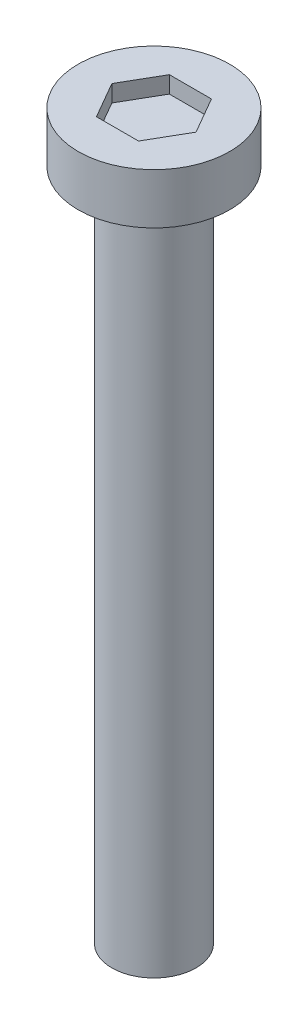
ISO-10303-21;
HEADER;
FILE_DESCRIPTION(('STEP AP214'),'2;1');
FILE_NAME('part.step','',(''),(''),'','','');
FILE_SCHEMA(('AUTOMOTIVE_DESIGN { 1 0 10303 214 1 1 1 1 }'));
ENDSEC;
DATA;
#1=APPLICATION_CONTEXT('core data for automotive mechanical design processes');
#2=APPLICATION_PROTOCOL_DEFINITION('international standard','automotive_design',2000,#1);
#3=PRODUCT_CONTEXT('',#1,'mechanical');
#4=PRODUCT('Part','Part','',(#3));
#5=PRODUCT_RELATED_PRODUCT_CATEGORY('part','',(#4));
#6=PRODUCT_DEFINITION_FORMATION('','',#4);
#7=PRODUCT_DEFINITION_CONTEXT('part definition',#1,'design');
#8=PRODUCT_DEFINITION('design','',#6,#7);
#9=PRODUCT_DEFINITION_SHAPE('','',#8);
#10=(LENGTH_UNIT() NAMED_UNIT(*) SI_UNIT(.MILLI.,.METRE.));
#11=(NAMED_UNIT(*) PLANE_ANGLE_UNIT() SI_UNIT($,.RADIAN.));
#12=(NAMED_UNIT(*) SI_UNIT($,.STERADIAN.) SOLID_ANGLE_UNIT());
#13=UNCERTAINTY_MEASURE_WITH_UNIT(LENGTH_MEASURE(1.E-05),#10,'distance_accuracy_value','');
#14=(GEOMETRIC_REPRESENTATION_CONTEXT(3) GLOBAL_UNCERTAINTY_ASSIGNED_CONTEXT((#13)) GLOBAL_UNIT_ASSIGNED_CONTEXT((#10,
#11,#12)) REPRESENTATION_CONTEXT('',''));
#15=CARTESIAN_POINT('',(0.,0.,0.));
#16=DIRECTION('',(0.,0.,1.));
#17=DIRECTION('',(1.,0.,0.));
#18=AXIS2_PLACEMENT_3D('',#15,#16,#17);
#19=CARTESIAN_POINT('',(0.,20.,0.));
#20=DIRECTION('',(0.,-1.,0.));
#21=DIRECTION('',(0.,0.,-1.));
#22=AXIS2_PLACEMENT_3D('',#19,#20,#21);
#23=CYLINDRICAL_SURFACE('',#22,1.25);
#24=CARTESIAN_POINT('',(0.,20.,0.));
#25=DIRECTION('',(0.,1.,0.));
#26=DIRECTION('',(0.,0.,1.));
#27=AXIS2_PLACEMENT_3D('',#24,#25,#26);
#28=CIRCLE('',#27,1.25);
#29=CARTESIAN_POINT('',(0.,20.,1.25));
#30=VERTEX_POINT('',#29);
#31=EDGE_CURVE('E11',#30,#30,#28,.T.);
#32=ORIENTED_EDGE('',*,*,#31,.F.);
#33=EDGE_LOOP('',(#32));
#34=FACE_BOUND('',#33,.T.);
#35=CARTESIAN_POINT('',(0.,0.,0.));
#36=DIRECTION('',(0.,1.,0.));
#37=DIRECTION('',(0.,0.,1.));
#38=AXIS2_PLACEMENT_3D('',#35,#36,#37);
#39=CIRCLE('',#38,1.25);
#40=CARTESIAN_POINT('',(0.,0.,1.25));
#41=VERTEX_POINT('',#40);
#42=EDGE_CURVE('E42',#41,#41,#39,.T.);
#43=ORIENTED_EDGE('',*,*,#42,.T.);
#44=EDGE_LOOP('',(#43));
#45=FACE_BOUND('',#44,.T.);
#46=ADVANCED_FACE('F39',(#34,#45),#23,.T.);
#47=CARTESIAN_POINT('',(0.,0.,0.));
#48=DIRECTION('',(0.,1.,0.));
#49=DIRECTION('',(0.,0.,1.));
#50=AXIS2_PLACEMENT_3D('',#47,#48,#49);
#51=PLANE('',#50);
#52=ORIENTED_EDGE('',*,*,#42,.F.);
#53=EDGE_LOOP('',(#52));
#54=FACE_BOUND('',#53,.T.);
#55=ADVANCED_FACE('F189',(#54),#51,.F.);
#56=CARTESIAN_POINT('',(0.,21.5,0.));
#57=DIRECTION('',(0.,-1.,0.));
#58=DIRECTION('',(0.,0.,-1.));
#59=AXIS2_PLACEMENT_3D('',#56,#57,#58);
#60=CYLINDRICAL_SURFACE('',#59,2.25);
#61=CARTESIAN_POINT('',(0.,21.5,0.));
#62=DIRECTION('',(0.,1.,0.));
#63=DIRECTION('',(0.,0.,1.));
#64=AXIS2_PLACEMENT_3D('',#61,#62,#63);
#65=CIRCLE('',#64,2.25);
#66=CARTESIAN_POINT('',(0.,21.5,2.25));
#67=VERTEX_POINT('',#66);
#68=EDGE_CURVE('E163',#67,#67,#65,.T.);
#69=ORIENTED_EDGE('',*,*,#68,.F.);
#70=EDGE_LOOP('',(#69));
#71=FACE_BOUND('',#70,.T.);
#72=CARTESIAN_POINT('',(0.,20.,0.));
#73=DIRECTION('',(0.,1.,0.));
#74=DIRECTION('',(0.,0.,1.));
#75=AXIS2_PLACEMENT_3D('',#72,#73,#74);
#76=CIRCLE('',#75,2.25);
#77=CARTESIAN_POINT('',(0.,20.,2.25));
#78=VERTEX_POINT('',#77);
#79=EDGE_CURVE('E153',#78,#78,#76,.T.);
#80=ORIENTED_EDGE('',*,*,#79,.T.);
#81=EDGE_LOOP('',(#80));
#82=FACE_BOUND('',#81,.T.);
#83=ADVANCED_FACE('F171',(#71,#82),#60,.T.);
#84=CARTESIAN_POINT('',(0.,21.5,0.));
#85=DIRECTION('',(0.,1.,0.));
#86=DIRECTION('',(0.,0.,1.));
#87=AXIS2_PLACEMENT_3D('',#84,#85,#86);
#88=PLANE('',#87);
#89=DIRECTION('',(0.5,0.,-0.866025403784439));
#90=VECTOR('',#89,1.);
#91=CARTESIAN_POINT('',(0.625,21.5,1.08253175473055));
#92=LINE('',#91,#90);
#93=CARTESIAN_POINT('',(0.625,21.5,1.08253175473055));
#94=VERTEX_POINT('',#93);
#95=CARTESIAN_POINT('',(1.25,21.5,0.));
#96=VERTEX_POINT('',#95);
#97=EDGE_CURVE('E54',#94,#96,#92,.T.);
#98=ORIENTED_EDGE('',*,*,#97,.F.);
#99=DIRECTION('',(1.,0.,0.));
#100=VECTOR('',#99,1.);
#101=CARTESIAN_POINT('',(-0.625,21.5,1.08253175473055));
#102=LINE('',#101,#100);
#103=CARTESIAN_POINT('',(-0.625,21.5,1.08253175473055));
#104=VERTEX_POINT('',#103);
#105=EDGE_CURVE('E147',#104,#94,#102,.T.);
#106=ORIENTED_EDGE('',*,*,#105,.F.);
#107=DIRECTION('',(0.5,0.,0.866025403784439));
#108=VECTOR('',#107,1.);
#109=CARTESIAN_POINT('',(-1.25,21.5,0.));
#110=LINE('',#109,#108);
#111=CARTESIAN_POINT('',(-1.25,21.5,0.));
#112=VERTEX_POINT('',#111);
#113=EDGE_CURVE('E144',#112,#104,#110,.T.);
#114=ORIENTED_EDGE('',*,*,#113,.F.);
#115=DIRECTION('',(-0.5,0.,0.866025403784439));
#116=VECTOR('',#115,1.);
#117=CARTESIAN_POINT('',(-0.625,21.5,-1.08253175473055));
#118=LINE('',#117,#116);
#119=CARTESIAN_POINT('',(-0.625,21.5,-1.08253175473055));
#120=VERTEX_POINT('',#119);
#121=EDGE_CURVE('E102',#120,#112,#118,.T.);
#122=ORIENTED_EDGE('',*,*,#121,.F.);
#123=DIRECTION('',(-1.,0.,0.));
#124=VECTOR('',#123,1.);
#125=CARTESIAN_POINT('',(0.625,21.5,-1.08253175473055));
#126=LINE('',#125,#124);
#127=CARTESIAN_POINT('',(0.625,21.5,-1.08253175473055));
#128=VERTEX_POINT('',#127);
#129=EDGE_CURVE('E138',#128,#120,#126,.T.);
#130=ORIENTED_EDGE('',*,*,#129,.F.);
#131=DIRECTION('',(-0.5,0.,-0.866025403784439));
#132=VECTOR('',#131,1.);
#133=CARTESIAN_POINT('',(1.25,21.5,0.));
#134=LINE('',#133,#132);
#135=EDGE_CURVE('E134',#96,#128,#134,.T.);
#136=ORIENTED_EDGE('',*,*,#135,.F.);
#137=EDGE_LOOP('',(#98,#106,#114,#122,#130,#136));
#138=FACE_BOUND('',#137,.T.);
#139=ORIENTED_EDGE('',*,*,#68,.T.);
#140=EDGE_LOOP('',(#139));
#141=FACE_BOUND('',#140,.T.);
#142=ADVANCED_FACE('F176',(#138,#141),#88,.T.);
#143=CARTESIAN_POINT('',(0.,20.,0.));
#144=DIRECTION('',(0.,1.,0.));
#145=DIRECTION('',(0.,0.,1.));
#146=AXIS2_PLACEMENT_3D('',#143,#144,#145);
#147=PLANE('',#146);
#148=ORIENTED_EDGE('',*,*,#31,.T.);
#149=EDGE_LOOP('',(#148));
#150=FACE_BOUND('',#149,.T.);
#151=ORIENTED_EDGE('',*,*,#79,.F.);
#152=EDGE_LOOP('',(#151));
#153=FACE_BOUND('',#152,.T.);
#154=ADVANCED_FACE('F173',(#150,#153),#147,.F.);
#155=CARTESIAN_POINT('',(0.625,21.,1.08253175473055));
#156=DIRECTION('',(0.866025403784439,0.,0.5));
#157=DIRECTION('',(0.5,0.,-0.866025403784439));
#158=AXIS2_PLACEMENT_3D('',#155,#156,#157);
#159=PLANE('',#158);
#160=ORIENTED_EDGE('',*,*,#97,.T.);
#161=DIRECTION('',(0.,1.,0.));
#162=VECTOR('',#161,1.);
#163=CARTESIAN_POINT('',(1.25,21.,0.));
#164=LINE('',#163,#162);
#165=CARTESIAN_POINT('',(1.25,21.,0.));
#166=VERTEX_POINT('',#165);
#167=EDGE_CURVE('E84',#166,#96,#164,.T.);
#168=ORIENTED_EDGE('',*,*,#167,.F.);
#169=DIRECTION('',(0.5,0.,-0.866025403784439));
#170=VECTOR('',#169,1.);
#171=CARTESIAN_POINT('',(0.625,21.,1.08253175473055));
#172=LINE('',#171,#170);
#173=CARTESIAN_POINT('',(0.625,21.,1.08253175473055));
#174=VERTEX_POINT('',#173);
#175=EDGE_CURVE('E150',#174,#166,#172,.T.);
#176=ORIENTED_EDGE('',*,*,#175,.F.);
#177=DIRECTION('',(0.,1.,0.));
#178=VECTOR('',#177,1.);
#179=CARTESIAN_POINT('',(0.625,21.,1.08253175473055));
#180=LINE('',#179,#178);
#181=EDGE_CURVE('E62',#174,#94,#180,.T.);
#182=ORIENTED_EDGE('',*,*,#181,.T.);
#183=EDGE_LOOP('',(#160,#168,#176,#182));
#184=FACE_BOUND('',#183,.T.);
#185=ADVANCED_FACE('F175',(#184),#159,.F.);
#186=CARTESIAN_POINT('',(-0.625,21.,1.08253175473055));
#187=DIRECTION('',(0.,0.,1.));
#188=DIRECTION('',(1.,0.,0.));
#189=AXIS2_PLACEMENT_3D('',#186,#187,#188);
#190=PLANE('',#189);
#191=ORIENTED_EDGE('',*,*,#105,.T.);
#192=ORIENTED_EDGE('',*,*,#181,.F.);
#193=DIRECTION('',(1.,0.,0.));
#194=VECTOR('',#193,1.);
#195=CARTESIAN_POINT('',(-0.625,21.,1.08253175473055));
#196=LINE('',#195,#194);
#197=CARTESIAN_POINT('',(-0.625,21.,1.08253175473055));
#198=VERTEX_POINT('',#197);
#199=EDGE_CURVE('E116',#198,#174,#196,.T.);
#200=ORIENTED_EDGE('',*,*,#199,.F.);
#201=DIRECTION('',(0.,1.,0.));
#202=VECTOR('',#201,1.);
#203=CARTESIAN_POINT('',(-0.625,21.,1.08253175473055));
#204=LINE('',#203,#202);
#205=EDGE_CURVE('E107',#198,#104,#204,.T.);
#206=ORIENTED_EDGE('',*,*,#205,.T.);
#207=EDGE_LOOP('',(#191,#192,#200,#206));
#208=FACE_BOUND('',#207,.T.);
#209=ADVANCED_FACE('F183',(#208),#190,.F.);
#210=CARTESIAN_POINT('',(-1.25,21.,0.));
#211=DIRECTION('',(-0.866025403784439,0.,0.5));
#212=DIRECTION('',(0.5,0.,0.866025403784439));
#213=AXIS2_PLACEMENT_3D('',#210,#211,#212);
#214=PLANE('',#213);
#215=ORIENTED_EDGE('',*,*,#113,.T.);
#216=ORIENTED_EDGE('',*,*,#205,.F.);
#217=DIRECTION('',(0.5,0.,0.866025403784439));
#218=VECTOR('',#217,1.);
#219=CARTESIAN_POINT('',(-1.25,21.,0.));
#220=LINE('',#219,#218);
#221=CARTESIAN_POINT('',(-1.25,21.,0.));
#222=VERTEX_POINT('',#221);
#223=EDGE_CURVE('E111',#222,#198,#220,.T.);
#224=ORIENTED_EDGE('',*,*,#223,.F.);
#225=DIRECTION('',(0.,1.,0.));
#226=VECTOR('',#225,1.);
#227=CARTESIAN_POINT('',(-1.25,21.,0.));
#228=LINE('',#227,#226);
#229=EDGE_CURVE('E95',#222,#112,#228,.T.);
#230=ORIENTED_EDGE('',*,*,#229,.T.);
#231=EDGE_LOOP('',(#215,#216,#224,#230));
#232=FACE_BOUND('',#231,.T.);
#233=ADVANCED_FACE('F112',(#232),#214,.F.);
#234=CARTESIAN_POINT('',(-0.625,21.,-1.08253175473055));
#235=DIRECTION('',(-0.866025403784439,0.,-0.5));
#236=DIRECTION('',(-0.5,0.,0.866025403784439));
#237=AXIS2_PLACEMENT_3D('',#234,#235,#236);
#238=PLANE('',#237);
#239=ORIENTED_EDGE('',*,*,#121,.T.);
#240=ORIENTED_EDGE('',*,*,#229,.F.);
#241=DIRECTION('',(-0.5,0.,0.866025403784439));
#242=VECTOR('',#241,1.);
#243=CARTESIAN_POINT('',(-0.625,21.,-1.08253175473055));
#244=LINE('',#243,#242);
#245=CARTESIAN_POINT('',(-0.625,21.,-1.08253175473055));
#246=VERTEX_POINT('',#245);
#247=EDGE_CURVE('E99',#246,#222,#244,.T.);
#248=ORIENTED_EDGE('',*,*,#247,.F.);
#249=DIRECTION('',(0.,1.,0.));
#250=VECTOR('',#249,1.);
#251=CARTESIAN_POINT('',(-0.625,21.,-1.08253175473055));
#252=LINE('',#251,#250);
#253=EDGE_CURVE('E108',#246,#120,#252,.T.);
#254=ORIENTED_EDGE('',*,*,#253,.T.);
#255=EDGE_LOOP('',(#239,#240,#248,#254));
#256=FACE_BOUND('',#255,.T.);
#257=ADVANCED_FACE('F97',(#256),#238,.F.);
#258=CARTESIAN_POINT('',(0.625,21.,-1.08253175473055));
#259=DIRECTION('',(0.,0.,-1.));
#260=DIRECTION('',(-1.,0.,0.));
#261=AXIS2_PLACEMENT_3D('',#258,#259,#260);
#262=PLANE('',#261);
#263=ORIENTED_EDGE('',*,*,#129,.T.);
#264=ORIENTED_EDGE('',*,*,#253,.F.);
#265=DIRECTION('',(-1.,0.,0.));
#266=VECTOR('',#265,1.);
#267=CARTESIAN_POINT('',(0.625,21.,-1.08253175473055));
#268=LINE('',#267,#266);
#269=CARTESIAN_POINT('',(0.625,21.,-1.08253175473055));
#270=VERTEX_POINT('',#269);
#271=EDGE_CURVE('E122',#270,#246,#268,.T.);
#272=ORIENTED_EDGE('',*,*,#271,.F.);
#273=DIRECTION('',(0.,1.,0.));
#274=VECTOR('',#273,1.);
#275=CARTESIAN_POINT('',(0.625,21.,-1.08253175473055));
#276=LINE('',#275,#274);
#277=EDGE_CURVE('E158',#270,#128,#276,.T.);
#278=ORIENTED_EDGE('',*,*,#277,.T.);
#279=EDGE_LOOP('',(#263,#264,#272,#278));
#280=FACE_BOUND('',#279,.T.);
#281=ADVANCED_FACE('F245',(#280),#262,.F.);
#282=CARTESIAN_POINT('',(1.25,21.,0.));
#283=DIRECTION('',(0.866025403784439,0.,-0.5));
#284=DIRECTION('',(-0.5,0.,-0.866025403784439));
#285=AXIS2_PLACEMENT_3D('',#282,#283,#284);
#286=PLANE('',#285);
#287=ORIENTED_EDGE('',*,*,#135,.T.);
#288=ORIENTED_EDGE('',*,*,#277,.F.);
#289=DIRECTION('',(-0.5,0.,-0.866025403784439));
#290=VECTOR('',#289,1.);
#291=CARTESIAN_POINT('',(1.25,21.,0.));
#292=LINE('',#291,#290);
#293=EDGE_CURVE('E126',#166,#270,#292,.T.);
#294=ORIENTED_EDGE('',*,*,#293,.F.);
#295=ORIENTED_EDGE('',*,*,#167,.T.);
#296=EDGE_LOOP('',(#287,#288,#294,#295));
#297=FACE_BOUND('',#296,.T.);
#298=ADVANCED_FACE('F254',(#297),#286,.F.);
#299=CARTESIAN_POINT('',(0.,21.,0.));
#300=DIRECTION('',(0.,1.,0.));
#301=DIRECTION('',(0.,0.,1.));
#302=AXIS2_PLACEMENT_3D('',#299,#300,#301);
#303=PLANE('',#302);
#304=ORIENTED_EDGE('',*,*,#175,.T.);
#305=ORIENTED_EDGE('',*,*,#293,.T.);
#306=ORIENTED_EDGE('',*,*,#271,.T.);
#307=ORIENTED_EDGE('',*,*,#247,.T.);
#308=ORIENTED_EDGE('',*,*,#223,.T.);
#309=ORIENTED_EDGE('',*,*,#199,.T.);
#310=EDGE_LOOP('',(#304,#305,#306,#307,#308,#309));
#311=FACE_BOUND('',#310,.T.);
#312=ADVANCED_FACE('F119',(#311),#303,.T.);
#313=CLOSED_SHELL('',(#46,#55,#83,#142,#154,#185,#209,#233,#257,#281,#298,#312));
#314=MANIFOLD_SOLID_BREP('B2',#313);
#315=ADVANCED_BREP_SHAPE_REPRESENTATION('',(#18,#314),#14);
#316=SHAPE_DEFINITION_REPRESENTATION(#9,#315);
ENDSEC;
END-ISO-10303-21;
